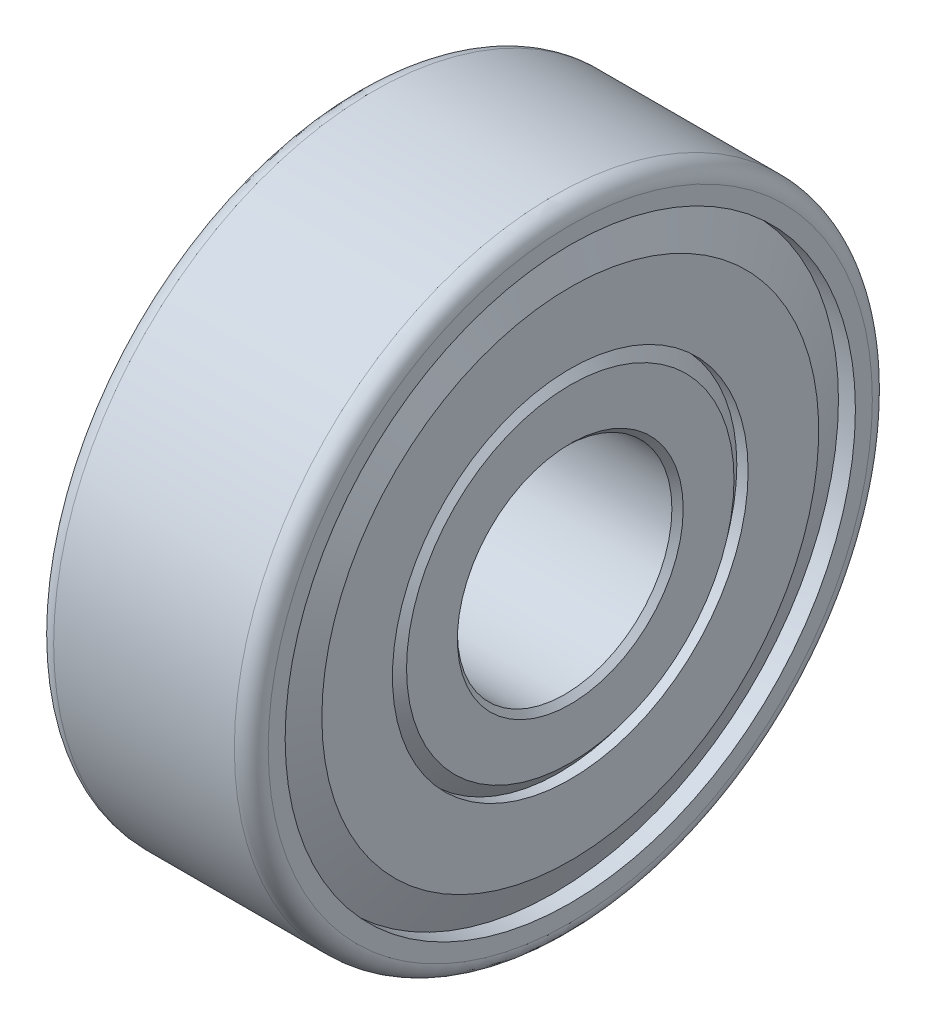
ISO-10303-21;
HEADER;
FILE_DESCRIPTION(('STEP AP214'),'2;1');
FILE_NAME('part.step','',(''),(''),'','','');
FILE_SCHEMA(('AUTOMOTIVE_DESIGN { 1 0 10303 214 1 1 1 1 }'));
ENDSEC;
DATA;
#1=APPLICATION_CONTEXT('core data for automotive mechanical design processes');
#2=APPLICATION_PROTOCOL_DEFINITION('international standard','automotive_design',2000,#1);
#3=PRODUCT_CONTEXT('',#1,'mechanical');
#4=PRODUCT('Part','Part','',(#3));
#5=PRODUCT_RELATED_PRODUCT_CATEGORY('part','',(#4));
#6=PRODUCT_DEFINITION_FORMATION('','',#4);
#7=PRODUCT_DEFINITION_CONTEXT('part definition',#1,'design');
#8=PRODUCT_DEFINITION('design','',#6,#7);
#9=PRODUCT_DEFINITION_SHAPE('','',#8);
#10=(LENGTH_UNIT() NAMED_UNIT(*) SI_UNIT(.MILLI.,.METRE.));
#11=(NAMED_UNIT(*) PLANE_ANGLE_UNIT() SI_UNIT($,.RADIAN.));
#12=(NAMED_UNIT(*) SI_UNIT($,.STERADIAN.) SOLID_ANGLE_UNIT());
#13=UNCERTAINTY_MEASURE_WITH_UNIT(LENGTH_MEASURE(1.E-05),#10,'distance_accuracy_value','');
#14=(GEOMETRIC_REPRESENTATION_CONTEXT(3) GLOBAL_UNCERTAINTY_ASSIGNED_CONTEXT((#13)) GLOBAL_UNIT_ASSIGNED_CONTEXT((#10,
#11,#12)) REPRESENTATION_CONTEXT('',''));
#15=CARTESIAN_POINT('',(0.,0.,0.));
#16=DIRECTION('',(0.,0.,1.));
#17=DIRECTION('',(1.,0.,0.));
#18=AXIS2_PLACEMENT_3D('',#15,#16,#17);
#19=CARTESIAN_POINT('',(0.,0.,0.));
#20=DIRECTION('',(1.,0.,0.));
#21=DIRECTION('',(0.,0.,-1.));
#22=AXIS2_PLACEMENT_3D('',#19,#20,#21);
#23=CYLINDRICAL_SURFACE('',#22,4.826);
#24=CARTESIAN_POINT('',(9.39799999997604,0.,0.));
#25=DIRECTION('',(1.,0.,0.));
#26=DIRECTION('',(0.,0.,-1.));
#27=AXIS2_PLACEMENT_3D('',#24,#25,#26);
#28=CIRCLE('',#27,4.82599999998001);
#29=CARTESIAN_POINT('',(9.39799999997604,0.,-4.82599999998001));
#30=VERTEX_POINT('',#29);
#31=EDGE_CURVE('E334',#30,#30,#28,.T.);
#32=ORIENTED_EDGE('',*,*,#31,.T.);
#33=EDGE_LOOP('',(#32));
#34=FACE_BOUND('',#33,.T.);
#35=CARTESIAN_POINT('',(0.254000000040833,0.,0.));
#36=DIRECTION('',(-1.,0.,0.));
#37=DIRECTION('',(0.,0.,1.));
#38=AXIS2_PLACEMENT_3D('',#35,#36,#37);
#39=CIRCLE('',#38,4.82599999998001);
#40=CARTESIAN_POINT('',(0.254000000040833,0.,4.82599999998001));
#41=VERTEX_POINT('',#40);
#42=EDGE_CURVE('E364',#41,#41,#39,.T.);
#43=ORIENTED_EDGE('',*,*,#42,.T.);
#44=EDGE_LOOP('',(#43));
#45=FACE_BOUND('',#44,.T.);
#46=ADVANCED_FACE('F16',(#34,#45),#23,.F.);
#47=CARTESIAN_POINT('',(9.65199999996003,0.,0.));
#48=DIRECTION('',(1.,0.,0.));
#49=DIRECTION('',(0.,0.,-1.));
#50=AXIS2_PLACEMENT_3D('',#47,#48,#49);
#51=CONICAL_SURFACE('',#50,5.079999999964,0.785398163397448);
#52=ORIENTED_EDGE('',*,*,#31,.F.);
#53=EDGE_LOOP('',(#52));
#54=FACE_BOUND('',#53,.T.);
#55=CARTESIAN_POINT('',(9.65199999996003,0.,0.));
#56=DIRECTION('',(1.,0.,0.));
#57=DIRECTION('',(0.,0.,-1.));
#58=AXIS2_PLACEMENT_3D('',#55,#56,#57);
#59=CIRCLE('',#58,5.079999999964);
#60=CARTESIAN_POINT('',(9.65199999996003,0.,-5.079999999964));
#61=VERTEX_POINT('',#60);
#62=EDGE_CURVE('E361',#61,#61,#59,.F.);
#63=ORIENTED_EDGE('',*,*,#62,.F.);
#64=EDGE_LOOP('',(#63));
#65=FACE_BOUND('',#64,.T.);
#66=ADVANCED_FACE('F174',(#54,#65),#51,.F.);
#67=CARTESIAN_POINT('',(0.,0.,0.));
#68=DIRECTION('',(-1.,0.,0.));
#69=DIRECTION('',(0.,0.,1.));
#70=AXIS2_PLACEMENT_3D('',#67,#68,#69);
#71=CONICAL_SURFACE('',#70,5.08000000007769,0.785398163509345);
#72=CARTESIAN_POINT('',(0.,0.,0.));
#73=DIRECTION('',(-1.,0.,0.));
#74=DIRECTION('',(0.,0.,1.));
#75=AXIS2_PLACEMENT_3D('',#72,#73,#74);
#76=CIRCLE('',#75,5.08000000007769);
#77=CARTESIAN_POINT('',(0.,0.,5.08000000007769));
#78=VERTEX_POINT('',#77);
#79=EDGE_CURVE('E358',#78,#78,#76,.T.);
#80=ORIENTED_EDGE('',*,*,#79,.T.);
#81=EDGE_LOOP('',(#80));
#82=FACE_BOUND('',#81,.T.);
#83=ORIENTED_EDGE('',*,*,#42,.F.);
#84=EDGE_LOOP('',(#83));
#85=FACE_BOUND('',#84,.T.);
#86=ADVANCED_FACE('F171',(#82,#85),#71,.F.);
#87=CARTESIAN_POINT('',(9.652,0.,0.));
#88=DIRECTION('',(1.,0.,0.));
#89=DIRECTION('',(0.,0.,-1.));
#90=AXIS2_PLACEMENT_3D('',#87,#88,#89);
#91=PLANE('',#90);
#92=CARTESIAN_POINT('',(9.652,0.,0.));
#93=DIRECTION('',(-1.,0.,0.));
#94=DIRECTION('',(0.,0.,1.));
#95=AXIS2_PLACEMENT_3D('',#92,#93,#94);
#96=CIRCLE('',#95,7.366);
#97=CARTESIAN_POINT('',(9.652,0.,7.366));
#98=VERTEX_POINT('',#97);
#99=EDGE_CURVE('E355',#98,#98,#96,.T.);
#100=ORIENTED_EDGE('',*,*,#99,.F.);
#101=EDGE_LOOP('',(#100));
#102=FACE_BOUND('',#101,.T.);
#103=ORIENTED_EDGE('',*,*,#62,.T.);
#104=EDGE_LOOP('',(#103));
#105=FACE_BOUND('',#104,.T.);
#106=ADVANCED_FACE('F167',(#102,#105),#91,.T.);
#107=CARTESIAN_POINT('',(0.,0.,0.));
#108=DIRECTION('',(1.,0.,0.));
#109=DIRECTION('',(0.,0.,-1.));
#110=AXIS2_PLACEMENT_3D('',#107,#108,#109);
#111=PLANE('',#110);
#112=CARTESIAN_POINT('',(0.,0.,0.));
#113=DIRECTION('',(1.,0.,0.));
#114=DIRECTION('',(0.,0.,-1.));
#115=AXIS2_PLACEMENT_3D('',#112,#113,#114);
#116=CIRCLE('',#115,7.366);
#117=CARTESIAN_POINT('',(0.,0.,-7.366));
#118=VERTEX_POINT('',#117);
#119=EDGE_CURVE('E351',#118,#118,#116,.T.);
#120=ORIENTED_EDGE('',*,*,#119,.F.);
#121=EDGE_LOOP('',(#120));
#122=FACE_BOUND('',#121,.T.);
#123=ORIENTED_EDGE('',*,*,#79,.F.);
#124=EDGE_LOOP('',(#123));
#125=FACE_BOUND('',#124,.T.);
#126=ADVANCED_FACE('F163',(#122,#125),#111,.F.);
#127=CARTESIAN_POINT('',(9.144,0.,0.));
#128=DIRECTION('',(-1.,0.,0.));
#129=DIRECTION('',(0.,0.,1.));
#130=AXIS2_PLACEMENT_3D('',#127,#128,#129);
#131=CONICAL_SURFACE('',#130,8.001,0.896055384571346);
#132=ORIENTED_EDGE('',*,*,#99,.T.);
#133=EDGE_LOOP('',(#132));
#134=FACE_BOUND('',#133,.T.);
#135=CARTESIAN_POINT('',(9.144,0.,0.));
#136=DIRECTION('',(1.,0.,0.));
#137=DIRECTION('',(0.,0.,-1.));
#138=AXIS2_PLACEMENT_3D('',#135,#136,#137);
#139=CIRCLE('',#138,8.001);
#140=CARTESIAN_POINT('',(9.144,0.,-8.001));
#141=VERTEX_POINT('',#140);
#142=EDGE_CURVE('E354',#141,#141,#139,.T.);
#143=ORIENTED_EDGE('',*,*,#142,.T.);
#144=EDGE_LOOP('',(#143));
#145=FACE_BOUND('',#144,.T.);
#146=ADVANCED_FACE('F159',(#134,#145),#131,.T.);
#147=CARTESIAN_POINT('',(0.507999999999999,0.,0.));
#148=DIRECTION('',(1.,0.,0.));
#149=DIRECTION('',(0.,0.,-1.));
#150=AXIS2_PLACEMENT_3D('',#147,#148,#149);
#151=CONICAL_SURFACE('',#150,8.001,0.896055384571345);
#152=ORIENTED_EDGE('',*,*,#119,.T.);
#153=EDGE_LOOP('',(#152));
#154=FACE_BOUND('',#153,.T.);
#155=CARTESIAN_POINT('',(0.508,0.,0.));
#156=DIRECTION('',(-1.,0.,0.));
#157=DIRECTION('',(0.,0.,1.));
#158=AXIS2_PLACEMENT_3D('',#155,#156,#157);
#159=CIRCLE('',#158,8.001);
#160=CARTESIAN_POINT('',(0.508,0.,8.001));
#161=VERTEX_POINT('',#160);
#162=EDGE_CURVE('E350',#161,#161,#159,.T.);
#163=ORIENTED_EDGE('',*,*,#162,.T.);
#164=EDGE_LOOP('',(#163));
#165=FACE_BOUND('',#164,.T.);
#166=ADVANCED_FACE('F155',(#154,#165),#151,.T.);
#167=CARTESIAN_POINT('',(9.144,0.,0.));
#168=DIRECTION('',(1.,0.,0.));
#169=DIRECTION('',(0.,0.,-1.));
#170=AXIS2_PLACEMENT_3D('',#167,#168,#169);
#171=CYLINDRICAL_SURFACE('',#170,8.001);
#172=CARTESIAN_POINT('',(9.652,0.,0.));
#173=DIRECTION('',(1.,0.,0.));
#174=DIRECTION('',(0.,0.,-1.));
#175=AXIS2_PLACEMENT_3D('',#172,#173,#174);
#176=CIRCLE('',#175,8.001);
#177=CARTESIAN_POINT('',(9.652,0.,-8.001));
#178=VERTEX_POINT('',#177);
#179=EDGE_CURVE('E347',#178,#178,#176,.F.);
#180=ORIENTED_EDGE('',*,*,#179,.F.);
#181=EDGE_LOOP('',(#180));
#182=FACE_BOUND('',#181,.T.);
#183=ORIENTED_EDGE('',*,*,#142,.F.);
#184=EDGE_LOOP('',(#183));
#185=FACE_BOUND('',#184,.T.);
#186=ADVANCED_FACE('F151',(#182,#185),#171,.F.);
#187=CARTESIAN_POINT('',(0.508,0.,0.));
#188=DIRECTION('',(-1.,0.,0.));
#189=DIRECTION('',(0.,0.,1.));
#190=AXIS2_PLACEMENT_3D('',#187,#188,#189);
#191=CYLINDRICAL_SURFACE('',#190,8.001);
#192=CARTESIAN_POINT('',(0.,0.,0.));
#193=DIRECTION('',(-1.,0.,0.));
#194=DIRECTION('',(0.,0.,1.));
#195=AXIS2_PLACEMENT_3D('',#192,#193,#194);
#196=CIRCLE('',#195,8.001);
#197=CARTESIAN_POINT('',(0.,0.,8.001));
#198=VERTEX_POINT('',#197);
#199=EDGE_CURVE('E344',#198,#198,#196,.T.);
#200=ORIENTED_EDGE('',*,*,#199,.T.);
#201=EDGE_LOOP('',(#200));
#202=FACE_BOUND('',#201,.T.);
#203=ORIENTED_EDGE('',*,*,#162,.F.);
#204=EDGE_LOOP('',(#203));
#205=FACE_BOUND('',#204,.T.);
#206=ADVANCED_FACE('F147',(#202,#205),#191,.F.);
#207=CARTESIAN_POINT('',(9.652,0.,0.));
#208=DIRECTION('',(1.,0.,0.));
#209=DIRECTION('',(0.,0.,-1.));
#210=AXIS2_PLACEMENT_3D('',#207,#208,#209);
#211=PLANE('',#210);
#212=CARTESIAN_POINT('',(9.652,0.,0.));
#213=DIRECTION('',(-1.,0.,0.));
#214=DIRECTION('',(0.,0.,1.));
#215=AXIS2_PLACEMENT_3D('',#212,#213,#214);
#216=CIRCLE('',#215,11.176);
#217=CARTESIAN_POINT('',(9.652,0.,11.176));
#218=VERTEX_POINT('',#217);
#219=EDGE_CURVE('E341',#218,#218,#216,.T.);
#220=ORIENTED_EDGE('',*,*,#219,.F.);
#221=EDGE_LOOP('',(#220));
#222=FACE_BOUND('',#221,.T.);
#223=ORIENTED_EDGE('',*,*,#179,.T.);
#224=EDGE_LOOP('',(#223));
#225=FACE_BOUND('',#224,.T.);
#226=ADVANCED_FACE('F143',(#222,#225),#211,.T.);
#227=CARTESIAN_POINT('',(0.,0.,0.));
#228=DIRECTION('',(1.,0.,0.));
#229=DIRECTION('',(0.,0.,-1.));
#230=AXIS2_PLACEMENT_3D('',#227,#228,#229);
#231=PLANE('',#230);
#232=ORIENTED_EDGE('',*,*,#199,.F.);
#233=EDGE_LOOP('',(#232));
#234=FACE_BOUND('',#233,.T.);
#235=CARTESIAN_POINT('',(0.,0.,0.));
#236=DIRECTION('',(1.,0.,0.));
#237=DIRECTION('',(0.,0.,-1.));
#238=AXIS2_PLACEMENT_3D('',#235,#236,#237);
#239=CIRCLE('',#238,11.176);
#240=CARTESIAN_POINT('',(0.,0.,-11.176));
#241=VERTEX_POINT('',#240);
#242=EDGE_CURVE('E337',#241,#241,#239,.T.);
#243=ORIENTED_EDGE('',*,*,#242,.F.);
#244=EDGE_LOOP('',(#243));
#245=FACE_BOUND('',#244,.T.);
#246=ADVANCED_FACE('F139',(#234,#245),#231,.F.);
#247=CARTESIAN_POINT('',(8.89,0.,0.));
#248=DIRECTION('',(-1.,0.,0.));
#249=DIRECTION('',(0.,0.,1.));
#250=AXIS2_PLACEMENT_3D('',#247,#248,#249);
#251=CONICAL_SURFACE('',#250,12.827,1.13838855122436);
#252=ORIENTED_EDGE('',*,*,#219,.T.);
#253=EDGE_LOOP('',(#252));
#254=FACE_BOUND('',#253,.T.);
#255=CARTESIAN_POINT('',(8.89,0.,0.));
#256=DIRECTION('',(1.,0.,0.));
#257=DIRECTION('',(0.,0.,-1.));
#258=AXIS2_PLACEMENT_3D('',#255,#256,#257);
#259=CIRCLE('',#258,12.827);
#260=CARTESIAN_POINT('',(8.89,0.,-12.827));
#261=VERTEX_POINT('',#260);
#262=EDGE_CURVE('E340',#261,#261,#259,.T.);
#263=ORIENTED_EDGE('',*,*,#262,.T.);
#264=EDGE_LOOP('',(#263));
#265=FACE_BOUND('',#264,.T.);
#266=ADVANCED_FACE('F135',(#254,#265),#251,.T.);
#267=CARTESIAN_POINT('',(0.762000000000002,0.,0.));
#268=DIRECTION('',(1.,0.,0.));
#269=DIRECTION('',(0.,0.,-1.));
#270=AXIS2_PLACEMENT_3D('',#267,#268,#269);
#271=CONICAL_SURFACE('',#270,12.827,1.13838855122436);
#272=ORIENTED_EDGE('',*,*,#242,.T.);
#273=EDGE_LOOP('',(#272));
#274=FACE_BOUND('',#273,.T.);
#275=CARTESIAN_POINT('',(0.762,0.,0.));
#276=DIRECTION('',(-1.,0.,0.));
#277=DIRECTION('',(0.,0.,1.));
#278=AXIS2_PLACEMENT_3D('',#275,#276,#277);
#279=CIRCLE('',#278,12.827);
#280=CARTESIAN_POINT('',(0.762,0.,12.827));
#281=VERTEX_POINT('',#280);
#282=EDGE_CURVE('E331',#281,#281,#279,.T.);
#283=ORIENTED_EDGE('',*,*,#282,.T.);
#284=EDGE_LOOP('',(#283));
#285=FACE_BOUND('',#284,.T.);
#286=ADVANCED_FACE('F131',(#274,#285),#271,.T.);
#287=CARTESIAN_POINT('',(8.89,0.,0.));
#288=DIRECTION('',(1.,0.,0.));
#289=DIRECTION('',(0.,0.,-1.));
#290=AXIS2_PLACEMENT_3D('',#287,#288,#289);
#291=CYLINDRICAL_SURFACE('',#290,12.827);
#292=CARTESIAN_POINT('',(9.652,0.,0.));
#293=DIRECTION('',(1.,0.,0.));
#294=DIRECTION('',(0.,0.,-1.));
#295=AXIS2_PLACEMENT_3D('',#292,#293,#294);
#296=CIRCLE('',#295,12.827);
#297=CARTESIAN_POINT('',(9.652,0.,-12.827));
#298=VERTEX_POINT('',#297);
#299=EDGE_CURVE('E328',#298,#298,#296,.F.);
#300=ORIENTED_EDGE('',*,*,#299,.F.);
#301=EDGE_LOOP('',(#300));
#302=FACE_BOUND('',#301,.T.);
#303=ORIENTED_EDGE('',*,*,#262,.F.);
#304=EDGE_LOOP('',(#303));
#305=FACE_BOUND('',#304,.T.);
#306=ADVANCED_FACE('F127',(#302,#305),#291,.F.);
#307=CARTESIAN_POINT('',(0.762,0.,0.));
#308=DIRECTION('',(-1.,0.,0.));
#309=DIRECTION('',(0.,0.,1.));
#310=AXIS2_PLACEMENT_3D('',#307,#308,#309);
#311=CYLINDRICAL_SURFACE('',#310,12.827);
#312=CARTESIAN_POINT('',(0.,0.,0.));
#313=DIRECTION('',(-1.,0.,0.));
#314=DIRECTION('',(0.,0.,1.));
#315=AXIS2_PLACEMENT_3D('',#312,#313,#314);
#316=CIRCLE('',#315,12.827);
#317=CARTESIAN_POINT('',(0.,0.,12.827));
#318=VERTEX_POINT('',#317);
#319=EDGE_CURVE('E52',#318,#318,#316,.T.);
#320=ORIENTED_EDGE('',*,*,#319,.T.);
#321=EDGE_LOOP('',(#320));
#322=FACE_BOUND('',#321,.T.);
#323=ORIENTED_EDGE('',*,*,#282,.F.);
#324=EDGE_LOOP('',(#323));
#325=FACE_BOUND('',#324,.T.);
#326=ADVANCED_FACE('F123',(#322,#325),#311,.F.);
#327=CARTESIAN_POINT('',(9.652,0.,0.));
#328=DIRECTION('',(1.,0.,0.));
#329=DIRECTION('',(0.,0.,-1.));
#330=AXIS2_PLACEMENT_3D('',#327,#328,#329);
#331=PLANE('',#330);
#332=CARTESIAN_POINT('',(9.652,0.,0.));
#333=DIRECTION('',(-1.,0.,0.));
#334=DIRECTION('',(0.,0.,1.));
#335=AXIS2_PLACEMENT_3D('',#332,#333,#334);
#336=CIRCLE('',#335,13.589);
#337=CARTESIAN_POINT('',(9.652,0.,13.589));
#338=VERTEX_POINT('',#337);
#339=CARTESIAN_POINT('',(9.652,0.,-13.589));
#340=VERTEX_POINT('',#339);
#341=EDGE_CURVE('E50',#338,#340,#336,.T.);
#342=ORIENTED_EDGE('',*,*,#341,.F.);
#343=CARTESIAN_POINT('',(9.652,0.,0.));
#344=DIRECTION('',(-1.,0.,0.));
#345=DIRECTION('',(0.,0.,-1.));
#346=AXIS2_PLACEMENT_3D('',#343,#344,#345);
#347=CIRCLE('',#346,13.589);
#348=EDGE_CURVE('E44',#340,#338,#347,.T.);
#349=ORIENTED_EDGE('',*,*,#348,.F.);
#350=EDGE_LOOP('',(#342,#349));
#351=FACE_BOUND('',#350,.T.);
#352=ORIENTED_EDGE('',*,*,#299,.T.);
#353=EDGE_LOOP('',(#352));
#354=FACE_BOUND('',#353,.T.);
#355=ADVANCED_FACE('F48',(#351,#354),#331,.T.);
#356=CARTESIAN_POINT('',(0.,0.,0.));
#357=DIRECTION('',(1.,0.,0.));
#358=DIRECTION('',(0.,0.,-1.));
#359=AXIS2_PLACEMENT_3D('',#356,#357,#358);
#360=PLANE('',#359);
#361=ORIENTED_EDGE('',*,*,#319,.F.);
#362=EDGE_LOOP('',(#361));
#363=FACE_BOUND('',#362,.T.);
#364=CARTESIAN_POINT('',(0.,0.,0.));
#365=DIRECTION('',(1.,0.,0.));
#366=DIRECTION('',(0.,0.,-1.));
#367=AXIS2_PLACEMENT_3D('',#364,#365,#366);
#368=CIRCLE('',#367,13.589);
#369=CARTESIAN_POINT('',(0.,0.,-13.589));
#370=VERTEX_POINT('',#369);
#371=CARTESIAN_POINT('',(0.,0.,13.589));
#372=VERTEX_POINT('',#371);
#373=EDGE_CURVE('E58',#370,#372,#368,.T.);
#374=ORIENTED_EDGE('',*,*,#373,.F.);
#375=CARTESIAN_POINT('',(0.,0.,0.));
#376=DIRECTION('',(1.,0.,0.));
#377=DIRECTION('',(0.,0.,1.));
#378=AXIS2_PLACEMENT_3D('',#375,#376,#377);
#379=CIRCLE('',#378,13.589);
#380=EDGE_CURVE('E35',#372,#370,#379,.T.);
#381=ORIENTED_EDGE('',*,*,#380,.F.);
#382=EDGE_LOOP('',(#374,#381));
#383=FACE_BOUND('',#382,.T.);
#384=ADVANCED_FACE('F78',(#363,#383),#360,.F.);
#385=CARTESIAN_POINT('',(8.89,0.,0.));
#386=DIRECTION('',(1.,0.,0.));
#387=DIRECTION('',(0.,0.,-1.));
#388=AXIS2_PLACEMENT_3D('',#385,#386,#387);
#389=TOROIDAL_SURFACE('',#388,13.589,0.762);
#390=ORIENTED_EDGE('',*,*,#348,.T.);
#391=ORIENTED_EDGE('',*,*,#341,.T.);
#392=EDGE_LOOP('',(#390,#391));
#393=FACE_BOUND('',#392,.T.);
#394=CARTESIAN_POINT('',(8.89,0.,0.));
#395=DIRECTION('',(-1.,0.,0.));
#396=DIRECTION('',(0.,0.,1.));
#397=AXIS2_PLACEMENT_3D('',#394,#395,#396);
#398=CIRCLE('',#397,14.351);
#399=CARTESIAN_POINT('',(8.89,0.,14.351));
#400=VERTEX_POINT('',#399);
#401=EDGE_CURVE('E27',#400,#400,#398,.T.);
#402=ORIENTED_EDGE('',*,*,#401,.F.);
#403=EDGE_LOOP('',(#402));
#404=FACE_BOUND('',#403,.T.);
#405=ADVANCED_FACE('F56',(#393,#404),#389,.T.);
#406=CARTESIAN_POINT('',(0.762000000000001,0.,0.));
#407=DIRECTION('',(1.,0.,0.));
#408=DIRECTION('',(0.,0.,-1.));
#409=AXIS2_PLACEMENT_3D('',#406,#407,#408);
#410=TOROIDAL_SURFACE('',#409,13.589,0.762);
#411=CARTESIAN_POINT('',(0.762000000000001,0.,0.));
#412=DIRECTION('',(-1.,0.,0.));
#413=DIRECTION('',(0.,0.,1.));
#414=AXIS2_PLACEMENT_3D('',#411,#412,#413);
#415=CIRCLE('',#414,14.351);
#416=CARTESIAN_POINT('',(0.762000000000001,0.,14.351));
#417=VERTEX_POINT('',#416);
#418=EDGE_CURVE('E11',#417,#417,#415,.F.);
#419=ORIENTED_EDGE('',*,*,#418,.F.);
#420=EDGE_LOOP('',(#419));
#421=FACE_BOUND('',#420,.T.);
#422=ORIENTED_EDGE('',*,*,#373,.T.);
#423=ORIENTED_EDGE('',*,*,#380,.T.);
#424=EDGE_LOOP('',(#422,#423));
#425=FACE_BOUND('',#424,.T.);
#426=ADVANCED_FACE('F77',(#421,#425),#410,.T.);
#427=CARTESIAN_POINT('',(9.652,0.,0.));
#428=DIRECTION('',(-1.,0.,0.));
#429=DIRECTION('',(0.,0.,1.));
#430=AXIS2_PLACEMENT_3D('',#427,#428,#429);
#431=CYLINDRICAL_SURFACE('',#430,14.351);
#432=ORIENTED_EDGE('',*,*,#418,.T.);
#433=EDGE_LOOP('',(#432));
#434=FACE_BOUND('',#433,.T.);
#435=ORIENTED_EDGE('',*,*,#401,.T.);
#436=EDGE_LOOP('',(#435));
#437=FACE_BOUND('',#436,.T.);
#438=ADVANCED_FACE('F185',(#434,#437),#431,.T.);
#439=CLOSED_SHELL('',(#46,#66,#86,#106,#126,#146,#166,#186,#206,#226,#246,#266,#286,#306,#326,
#355,#384,#405,#426,#438));
#440=MANIFOLD_SOLID_BREP('B1',#439);
#441=ADVANCED_BREP_SHAPE_REPRESENTATION('',(#18,#440),#14);
#442=SHAPE_DEFINITION_REPRESENTATION(#9,#441);
ENDSEC;
END-ISO-10303-21;
